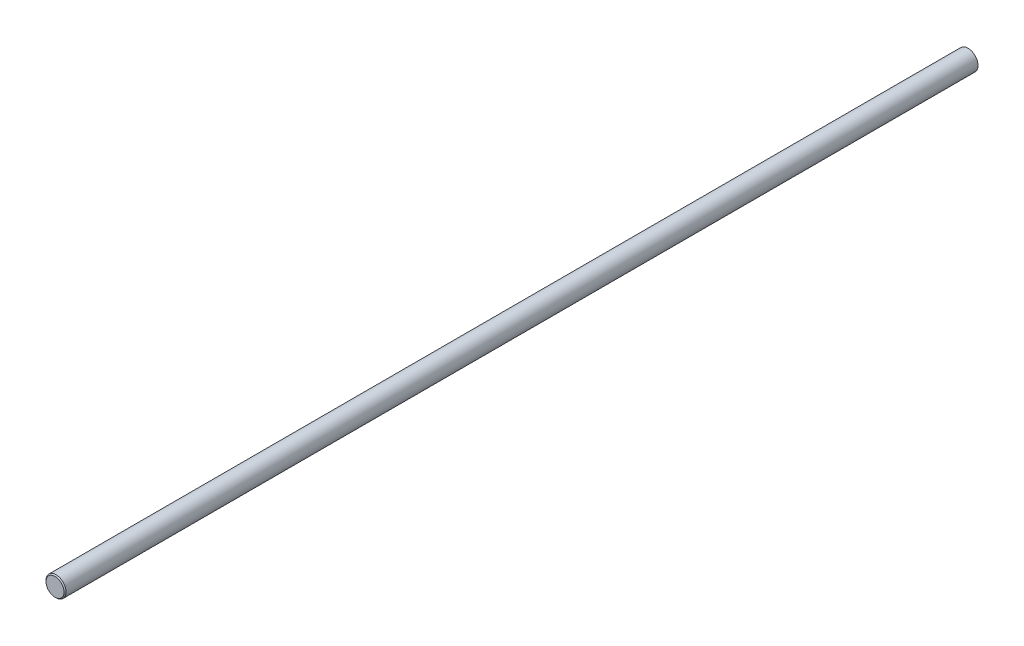
ISO-10303-21;
HEADER;
FILE_DESCRIPTION(('STEP AP214'),'2;1');
FILE_NAME('part.step','',(''),(''),'','','');
FILE_SCHEMA(('AUTOMOTIVE_DESIGN { 1 0 10303 214 1 1 1 1 }'));
ENDSEC;
DATA;
#1=APPLICATION_CONTEXT('core data for automotive mechanical design processes');
#2=APPLICATION_PROTOCOL_DEFINITION('international standard','automotive_design',2000,#1);
#3=PRODUCT_CONTEXT('',#1,'mechanical');
#4=PRODUCT('Part','Part','',(#3));
#5=PRODUCT_RELATED_PRODUCT_CATEGORY('part','',(#4));
#6=PRODUCT_DEFINITION_FORMATION('','',#4);
#7=PRODUCT_DEFINITION_CONTEXT('part definition',#1,'design');
#8=PRODUCT_DEFINITION('design','',#6,#7);
#9=PRODUCT_DEFINITION_SHAPE('','',#8);
#10=(LENGTH_UNIT() NAMED_UNIT(*) SI_UNIT(.MILLI.,.METRE.));
#11=(NAMED_UNIT(*) PLANE_ANGLE_UNIT() SI_UNIT($,.RADIAN.));
#12=(NAMED_UNIT(*) SI_UNIT($,.STERADIAN.) SOLID_ANGLE_UNIT());
#13=UNCERTAINTY_MEASURE_WITH_UNIT(LENGTH_MEASURE(1.E-05),#10,'distance_accuracy_value','');
#14=(GEOMETRIC_REPRESENTATION_CONTEXT(3) GLOBAL_UNCERTAINTY_ASSIGNED_CONTEXT((#13)) GLOBAL_UNIT_ASSIGNED_CONTEXT((#10,
#11,#12)) REPRESENTATION_CONTEXT('',''));
#15=CARTESIAN_POINT('',(0.,0.,0.));
#16=DIRECTION('',(0.,0.,1.));
#17=DIRECTION('',(1.,0.,0.));
#18=AXIS2_PLACEMENT_3D('',#15,#16,#17);
#19=CARTESIAN_POINT('',(0.,0.,0.));
#20=DIRECTION('',(0.,0.,1.));
#21=DIRECTION('',(1.,0.,0.));
#22=AXIS2_PLACEMENT_3D('',#19,#20,#21);
#23=CYLINDRICAL_SURFACE('',#22,15.48);
#24=CARTESIAN_POINT('',(1.83891432551468E-13,0.,1501.5875));
#25=DIRECTION('',(0.,0.,1.));
#26=DIRECTION('',(1.,0.,0.));
#27=AXIS2_PLACEMENT_3D('',#24,#25,#26);
#28=CIRCLE('',#27,15.48);
#29=CARTESIAN_POINT('',(15.4800000000002,0.,1501.5875));
#30=VERTEX_POINT('',#29);
#31=EDGE_CURVE('E59',#30,#30,#28,.T.);
#32=ORIENTED_EDGE('',*,*,#31,.T.);
#33=EDGE_LOOP('',(#32));
#34=FACE_BOUND('',#33,.T.);
#35=CARTESIAN_POINT('',(0.,0.,0.));
#36=DIRECTION('',(0.,0.,1.));
#37=DIRECTION('',(1.,0.,0.));
#38=AXIS2_PLACEMENT_3D('',#35,#36,#37);
#39=CIRCLE('',#38,15.48);
#40=CARTESIAN_POINT('',(15.48,0.,0.));
#41=VERTEX_POINT('',#40);
#42=EDGE_CURVE('E12',#41,#41,#39,.T.);
#43=ORIENTED_EDGE('',*,*,#42,.F.);
#44=EDGE_LOOP('',(#43));
#45=FACE_BOUND('',#44,.T.);
#46=ADVANCED_FACE('F40',(#34,#45),#23,.F.);
#47=CARTESIAN_POINT('',(16.7499999999999,0.,0.));
#48=DIRECTION('',(0.,0.,-1.));
#49=DIRECTION('',(-1.,0.,0.));
#50=AXIS2_PLACEMENT_3D('',#47,#48,#49);
#51=PLANE('',#50);
#52=ORIENTED_EDGE('',*,*,#42,.T.);
#53=EDGE_LOOP('',(#52));
#54=FACE_BOUND('',#53,.T.);
#55=CARTESIAN_POINT('',(0.,0.,0.));
#56=DIRECTION('',(0.,0.,1.));
#57=DIRECTION('',(1.,0.,0.));
#58=AXIS2_PLACEMENT_3D('',#55,#56,#57);
#59=CIRCLE('',#58,16.7499999999999);
#60=CARTESIAN_POINT('',(16.7499999999999,0.,0.));
#61=VERTEX_POINT('',#60);
#62=EDGE_CURVE('E46',#61,#61,#59,.T.);
#63=ORIENTED_EDGE('',*,*,#62,.F.);
#64=EDGE_LOOP('',(#63));
#65=FACE_BOUND('',#64,.T.);
#66=ADVANCED_FACE('F76',(#54,#65),#51,.T.);
#67=CARTESIAN_POINT('',(0.,0.,0.));
#68=DIRECTION('',(0.,0.,1.));
#69=DIRECTION('',(1.,0.,0.));
#70=AXIS2_PLACEMENT_3D('',#67,#68,#69);
#71=CYLINDRICAL_SURFACE('',#70,16.7499999999999);
#72=ORIENTED_EDGE('',*,*,#62,.T.);
#73=EDGE_LOOP('',(#72));
#74=FACE_BOUND('',#73,.T.);
#75=CARTESIAN_POINT('',(1.86614740871072E-13,0.,1523.825));
#76=DIRECTION('',(0.,0.,1.));
#77=DIRECTION('',(1.,0.,0.));
#78=AXIS2_PLACEMENT_3D('',#75,#76,#77);
#79=CIRCLE('',#78,16.7499999999999);
#80=CARTESIAN_POINT('',(16.7500000000001,0.,1523.825));
#81=VERTEX_POINT('',#80);
#82=EDGE_CURVE('E50',#81,#81,#79,.T.);
#83=ORIENTED_EDGE('',*,*,#82,.F.);
#84=EDGE_LOOP('',(#83));
#85=FACE_BOUND('',#84,.T.);
#86=ADVANCED_FACE('F80',(#74,#85),#71,.T.);
#87=CARTESIAN_POINT('',(1.86819869209929E-13,0.,1525.5));
#88=DIRECTION('',(0.,0.,-1.));
#89=DIRECTION('',(-1.,0.,0.));
#90=AXIS2_PLACEMENT_3D('',#87,#88,#89);
#91=CONICAL_SURFACE('',#90,15.0750000000001,0.785398163397487);
#92=ORIENTED_EDGE('',*,*,#82,.T.);
#93=EDGE_LOOP('',(#92));
#94=FACE_BOUND('',#93,.T.);
#95=CARTESIAN_POINT('',(1.86819869209929E-13,0.,1525.5));
#96=DIRECTION('',(0.,0.,1.));
#97=DIRECTION('',(1.,0.,0.));
#98=AXIS2_PLACEMENT_3D('',#95,#96,#97);
#99=CIRCLE('',#98,15.0750000000001);
#100=CARTESIAN_POINT('',(15.0750000000003,0.,1525.5));
#101=VERTEX_POINT('',#100);
#102=EDGE_CURVE('E54',#101,#101,#99,.T.);
#103=ORIENTED_EDGE('',*,*,#102,.F.);
#104=EDGE_LOOP('',(#103));
#105=FACE_BOUND('',#104,.T.);
#106=ADVANCED_FACE('F72',(#94,#105),#91,.T.);
#107=CARTESIAN_POINT('',(1.86819869209929E-13,0.,1525.5));
#108=DIRECTION('',(0.,0.,1.));
#109=DIRECTION('',(1.,0.,0.));
#110=AXIS2_PLACEMENT_3D('',#107,#108,#109);
#111=PLANE('',#110);
#112=ORIENTED_EDGE('',*,*,#102,.T.);
#113=EDGE_LOOP('',(#112));
#114=FACE_BOUND('',#113,.T.);
#115=ADVANCED_FACE('F67',(#114),#111,.T.);
#116=CARTESIAN_POINT('',(15.4800000000002,0.,1501.5875));
#117=DIRECTION('',(0.,0.,-1.));
#118=DIRECTION('',(-1.,0.,0.));
#119=AXIS2_PLACEMENT_3D('',#116,#117,#118);
#120=PLANE('',#119);
#121=ORIENTED_EDGE('',*,*,#31,.F.);
#122=EDGE_LOOP('',(#121));
#123=FACE_BOUND('',#122,.T.);
#124=ADVANCED_FACE('F65',(#123),#120,.T.);
#125=CLOSED_SHELL('',(#46,#66,#86,#106,#115,#124));
#126=MANIFOLD_SOLID_BREP('B2',#125);
#127=ADVANCED_BREP_SHAPE_REPRESENTATION('',(#18,#126),#14);
#128=SHAPE_DEFINITION_REPRESENTATION(#9,#127);
ENDSEC;
END-ISO-10303-21;
